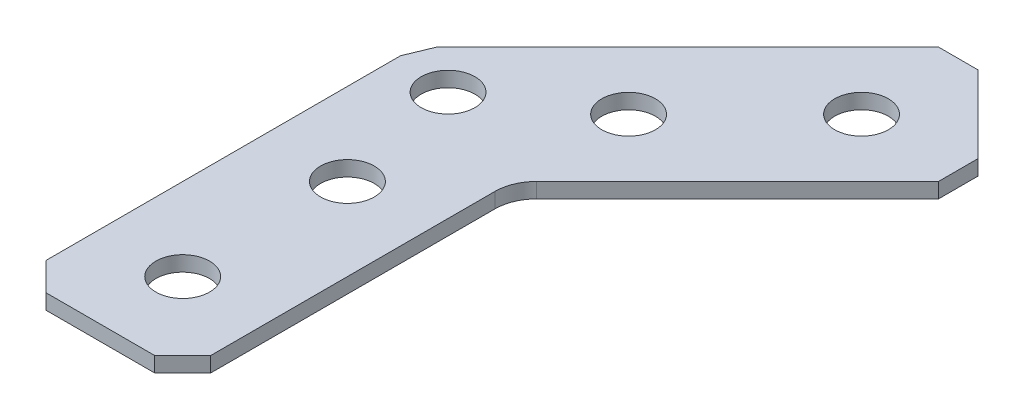
ISO-10303-21;
HEADER;
FILE_DESCRIPTION(('STEP AP214'),'2;1');
FILE_NAME('part.step','',(''),(''),'','','');
FILE_SCHEMA(('AUTOMOTIVE_DESIGN { 1 0 10303 214 1 1 1 1 }'));
ENDSEC;
DATA;
#1=APPLICATION_CONTEXT('core data for automotive mechanical design processes');
#2=APPLICATION_PROTOCOL_DEFINITION('international standard','automotive_design',2000,#1);
#3=PRODUCT_CONTEXT('',#1,'mechanical');
#4=PRODUCT('Part','Part','',(#3));
#5=PRODUCT_RELATED_PRODUCT_CATEGORY('part','',(#4));
#6=PRODUCT_DEFINITION_FORMATION('','',#4);
#7=PRODUCT_DEFINITION_CONTEXT('part definition',#1,'design');
#8=PRODUCT_DEFINITION('design','',#6,#7);
#9=PRODUCT_DEFINITION_SHAPE('','',#8);
#10=(LENGTH_UNIT() NAMED_UNIT(*) SI_UNIT(.MILLI.,.METRE.));
#11=(NAMED_UNIT(*) PLANE_ANGLE_UNIT() SI_UNIT($,.RADIAN.));
#12=(NAMED_UNIT(*) SI_UNIT($,.STERADIAN.) SOLID_ANGLE_UNIT());
#13=UNCERTAINTY_MEASURE_WITH_UNIT(LENGTH_MEASURE(1.E-05),#10,'distance_accuracy_value','');
#14=(GEOMETRIC_REPRESENTATION_CONTEXT(3) GLOBAL_UNCERTAINTY_ASSIGNED_CONTEXT((#13)) GLOBAL_UNIT_ASSIGNED_CONTEXT((#10,
#11,#12)) REPRESENTATION_CONTEXT('',''));
#15=CARTESIAN_POINT('',(0.,0.,0.));
#16=DIRECTION('',(0.,0.,1.));
#17=DIRECTION('',(1.,0.,0.));
#18=AXIS2_PLACEMENT_3D('',#15,#16,#17);
#19=CARTESIAN_POINT('',(-6.34999999999996,1.1684,12.7));
#20=DIRECTION('',(0.,-1.,0.));
#21=DIRECTION('',(0.,0.,-1.));
#22=AXIS2_PLACEMENT_3D('',#19,#20,#21);
#23=PLANE('',#22);
#24=CARTESIAN_POINT('',(15.3302561210692,1.1684,-30.6605122421383));
#25=DIRECTION('',(0.,-1.,0.));
#26=DIRECTION('',(0.,0.,-1.));
#27=AXIS2_PLACEMENT_3D('',#24,#25,#26);
#28=CIRCLE('',#27,2.0701);
#29=CARTESIAN_POINT('',(15.3302561210692,1.1684,-32.7306122421383));
#30=VERTEX_POINT('',#29);
#31=EDGE_CURVE('E229',#30,#30,#28,.T.);
#32=ORIENTED_EDGE('',*,*,#31,.T.);
#33=EDGE_LOOP('',(#32));
#34=FACE_BOUND('',#33,.T.);
#35=CARTESIAN_POINT('',(0.,1.1684,-6.35000000000009));
#36=DIRECTION('',(0.,-1.,0.));
#37=DIRECTION('',(0.,0.,-1.));
#38=AXIS2_PLACEMENT_3D('',#35,#36,#37);
#39=CIRCLE('',#38,2.07009999999998);
#40=CARTESIAN_POINT('',(0.,1.1684,-8.42010000000007));
#41=VERTEX_POINT('',#40);
#42=EDGE_CURVE('E232',#41,#41,#39,.T.);
#43=ORIENTED_EDGE('',*,*,#42,.T.);
#44=EDGE_LOOP('',(#43));
#45=FACE_BOUND('',#44,.T.);
#46=CARTESIAN_POINT('',(-2.08546691384424,1.1684,-16.1940848006638));
#47=DIRECTION('',(0.,-1.,0.));
#48=DIRECTION('',(0.,0.,-1.));
#49=AXIS2_PLACEMENT_3D('',#46,#47,#48);
#50=CIRCLE('',#49,2.0701);
#51=CARTESIAN_POINT('',(-2.08546691384424,1.1684,-18.2641848006638));
#52=VERTEX_POINT('',#51);
#53=EDGE_CURVE('E235',#52,#52,#50,.T.);
#54=ORIENTED_EDGE('',*,*,#53,.T.);
#55=EDGE_LOOP('',(#54));
#56=FACE_BOUND('',#55,.T.);
#57=DIRECTION('',(1.,0.,0.));
#58=VECTOR('',#57,1.);
#59=CARTESIAN_POINT('',(13.8036125804875,1.1684,-38.1141248226257));
#60=LINE('',#59,#58);
#61=CARTESIAN_POINT('',(16.856899661651,1.1684,-38.1141248226257));
#62=VERTEX_POINT('',#61);
#63=CARTESIAN_POINT('',(13.8036125804875,1.1684,-38.1141248226257));
#64=VERTEX_POINT('',#63);
#65=EDGE_CURVE('E168',#62,#64,#60,.F.);
#66=ORIENTED_EDGE('',*,*,#65,.T.);
#67=DIRECTION('',(0.707106781186549,0.,-0.707106781186546));
#68=VECTOR('',#67,1.);
#69=CARTESIAN_POINT('',(-5.52378646952377,1.1684,-18.7867257726145));
#70=LINE('',#69,#68);
#71=CARTESIAN_POINT('',(-5.52378646952377,1.1684,-18.7867257726145));
#72=VERTEX_POINT('',#71);
#73=EDGE_CURVE('E169',#64,#72,#70,.F.);
#74=ORIENTED_EDGE('',*,*,#73,.T.);
#75=DIRECTION('',(0.38268343236509,0.,-0.923879532511287));
#76=VECTOR('',#75,1.);
#77=CARTESIAN_POINT('',(-6.35,1.1684,-16.7920698619227));
#78=LINE('',#77,#76);
#79=CARTESIAN_POINT('',(-6.34999999999999,1.1684,-16.7920698619227));
#80=VERTEX_POINT('',#79);
#81=EDGE_CURVE('E180',#72,#80,#78,.F.);
#82=ORIENTED_EDGE('',*,*,#81,.T.);
#83=DIRECTION('',(0.,0.,-1.));
#84=VECTOR('',#83,1.);
#85=CARTESIAN_POINT('',(-6.34999999999999,1.1684,-12.7));
#86=LINE('',#85,#84);
#87=CARTESIAN_POINT('',(-6.34999999999998,1.1684,10.541));
#88=VERTEX_POINT('',#87);
#89=EDGE_CURVE('E472',#80,#88,#86,.F.);
#90=ORIENTED_EDGE('',*,*,#89,.T.);
#91=DIRECTION('',(-0.707106781186546,0.,-0.707106781186549));
#92=VECTOR('',#91,1.);
#93=CARTESIAN_POINT('',(-4.191,1.1684,12.7));
#94=LINE('',#93,#92);
#95=CARTESIAN_POINT('',(-4.191,1.1684,12.7));
#96=VERTEX_POINT('',#95);
#97=EDGE_CURVE('E474',#88,#96,#94,.F.);
#98=ORIENTED_EDGE('',*,*,#97,.T.);
#99=DIRECTION('',(-1.,0.,0.));
#100=VECTOR('',#99,1.);
#101=CARTESIAN_POINT('',(-6.34999999999999,1.1684,12.7));
#102=LINE('',#101,#100);
#103=CARTESIAN_POINT('',(4.19099999999999,1.1684,12.7));
#104=VERTEX_POINT('',#103);
#105=EDGE_CURVE('E479',#96,#104,#102,.F.);
#106=ORIENTED_EDGE('',*,*,#105,.T.);
#107=DIRECTION('',(-0.707106781186549,0.,0.707106781186546));
#108=VECTOR('',#107,1.);
#109=CARTESIAN_POINT('',(6.35,1.1684,10.541));
#110=LINE('',#109,#108);
#111=CARTESIAN_POINT('',(6.35,1.1684,10.541));
#112=VERTEX_POINT('',#111);
#113=EDGE_CURVE('E202',#104,#112,#110,.F.);
#114=ORIENTED_EDGE('',*,*,#113,.T.);
#115=DIRECTION('',(0.,0.,1.));
#116=VECTOR('',#115,1.);
#117=CARTESIAN_POINT('',(6.35,1.1684,-12.7));
#118=LINE('',#117,#116);
#119=CARTESIAN_POINT('',(6.35,1.1684,-11.3848719394654));
#120=VERTEX_POINT('',#119);
#121=EDGE_CURVE('E124',#112,#120,#118,.F.);
#122=ORIENTED_EDGE('',*,*,#121,.T.);
#123=CARTESIAN_POINT('',(9.525,1.1684,-11.3848719394654));
#124=DIRECTION('',(0.,1.,0.));
#125=DIRECTION('',(0.,0.,1.));
#126=AXIS2_PLACEMENT_3D('',#123,#124,#125);
#127=CIRCLE('',#126,3.175);
#128=CARTESIAN_POINT('',(7.27993596973271,1.1684,-13.6299359697327));
#129=VERTEX_POINT('',#128);
#130=EDGE_CURVE('E105',#120,#129,#127,.F.);
#131=ORIENTED_EDGE('',*,*,#130,.T.);
#132=DIRECTION('',(-0.707106781186549,0.,0.707106781186546));
#133=VECTOR('',#132,1.);
#134=CARTESIAN_POINT('',(24.3105122421383,1.1684,-30.6605122421383));
#135=LINE('',#134,#133);
#136=CARTESIAN_POINT('',(22.7838687015566,1.1684,-29.1338687015565));
#137=VERTEX_POINT('',#136);
#138=EDGE_CURVE('E110',#129,#137,#135,.F.);
#139=ORIENTED_EDGE('',*,*,#138,.T.);
#140=DIRECTION('',(0.,0.,1.));
#141=VECTOR('',#140,1.);
#142=CARTESIAN_POINT('',(22.7838687015566,1.1684,-32.18715578272));
#143=LINE('',#142,#141);
#144=CARTESIAN_POINT('',(22.7838687015566,1.1684,-32.18715578272));
#145=VERTEX_POINT('',#144);
#146=EDGE_CURVE('E119',#137,#145,#143,.F.);
#147=ORIENTED_EDGE('',*,*,#146,.T.);
#148=DIRECTION('',(0.707106781186546,0.,0.707106781186549));
#149=VECTOR('',#148,1.);
#150=CARTESIAN_POINT('',(15.3302561210692,1.1684,-39.6407683632074));
#151=LINE('',#150,#149);
#152=EDGE_CURVE('E158',#145,#62,#151,.F.);
#153=ORIENTED_EDGE('',*,*,#152,.T.);
#154=EDGE_LOOP('',(#66,#74,#82,#90,#98,#106,#114,#122,#131,#139,#147,#153));
#155=FACE_BOUND('',#154,.T.);
#156=CARTESIAN_POINT('',(0.,1.1684,6.35));
#157=DIRECTION('',(0.,-1.,0.));
#158=DIRECTION('',(0.,0.,-1.));
#159=AXIS2_PLACEMENT_3D('',#156,#157,#158);
#160=CIRCLE('',#159,2.0701);
#161=CARTESIAN_POINT('',(0.,1.1684,4.2799));
#162=VERTEX_POINT('',#161);
#163=EDGE_CURVE('E192',#162,#162,#160,.T.);
#164=ORIENTED_EDGE('',*,*,#163,.T.);
#165=EDGE_LOOP('',(#164));
#166=FACE_BOUND('',#165,.T.);
#167=CARTESIAN_POINT('',(6.34999999999998,1.1684,-21.6802561210692));
#168=DIRECTION('',(0.,-1.,0.));
#169=DIRECTION('',(0.,0.,-1.));
#170=AXIS2_PLACEMENT_3D('',#167,#168,#169);
#171=CIRCLE('',#170,2.0701);
#172=CARTESIAN_POINT('',(6.34999999999998,1.1684,-23.7503561210692));
#173=VERTEX_POINT('',#172);
#174=EDGE_CURVE('E21',#173,#173,#171,.T.);
#175=ORIENTED_EDGE('',*,*,#174,.T.);
#176=EDGE_LOOP('',(#175));
#177=FACE_BOUND('',#176,.T.);
#178=ADVANCED_FACE('F18',(#34,#45,#56,#155,#166,#177),#23,.F.);
#179=CARTESIAN_POINT('',(6.34999999999998,1.1684,-21.6802561210692));
#180=DIRECTION('',(0.,-1.,0.));
#181=DIRECTION('',(0.,0.,-1.));
#182=AXIS2_PLACEMENT_3D('',#179,#180,#181);
#183=CYLINDRICAL_SURFACE('',#182,2.0701);
#184=ORIENTED_EDGE('',*,*,#174,.F.);
#185=EDGE_LOOP('',(#184));
#186=FACE_BOUND('',#185,.T.);
#187=CARTESIAN_POINT('',(6.34999999999998,0.,-21.6802561210692));
#188=DIRECTION('',(0.,-1.,0.));
#189=DIRECTION('',(0.,0.,-1.));
#190=AXIS2_PLACEMENT_3D('',#187,#188,#189);
#191=CIRCLE('',#190,2.0701);
#192=CARTESIAN_POINT('',(6.34999999999998,0.,-23.7503561210692));
#193=VERTEX_POINT('',#192);
#194=EDGE_CURVE('E226',#193,#193,#191,.F.);
#195=ORIENTED_EDGE('',*,*,#194,.F.);
#196=EDGE_LOOP('',(#195));
#197=FACE_BOUND('',#196,.T.);
#198=ADVANCED_FACE('F243',(#186,#197),#183,.F.);
#199=CARTESIAN_POINT('',(0.,1.1684,6.35));
#200=DIRECTION('',(0.,-1.,0.));
#201=DIRECTION('',(0.,0.,-1.));
#202=AXIS2_PLACEMENT_3D('',#199,#200,#201);
#203=CYLINDRICAL_SURFACE('',#202,2.0701);
#204=ORIENTED_EDGE('',*,*,#163,.F.);
#205=EDGE_LOOP('',(#204));
#206=FACE_BOUND('',#205,.T.);
#207=CARTESIAN_POINT('',(0.,0.,6.35));
#208=DIRECTION('',(0.,-1.,0.));
#209=DIRECTION('',(0.,0.,-1.));
#210=AXIS2_PLACEMENT_3D('',#207,#208,#209);
#211=CIRCLE('',#210,2.0701);
#212=CARTESIAN_POINT('',(0.,0.,4.2799));
#213=VERTEX_POINT('',#212);
#214=EDGE_CURVE('E174',#213,#213,#211,.F.);
#215=ORIENTED_EDGE('',*,*,#214,.F.);
#216=EDGE_LOOP('',(#215));
#217=FACE_BOUND('',#216,.T.);
#218=ADVANCED_FACE('F246',(#206,#217),#203,.F.);
#219=CARTESIAN_POINT('',(-5.52378646952377,1.1684,-18.7867257726145));
#220=DIRECTION('',(0.707106781186546,0.,0.707106781186549));
#221=DIRECTION('',(0.707106781186549,0.,-0.707106781186546));
#222=AXIS2_PLACEMENT_3D('',#219,#220,#221);
#223=PLANE('',#222);
#224=DIRECTION('',(0.,1.,0.));
#225=VECTOR('',#224,1.);
#226=CARTESIAN_POINT('',(13.8036125804874,1.1684,-38.1141248226257));
#227=LINE('',#226,#225);
#228=CARTESIAN_POINT('',(13.8036125804875,0.,-38.1141248226257));
#229=VERTEX_POINT('',#228);
#230=EDGE_CURVE('E166',#64,#229,#227,.F.);
#231=ORIENTED_EDGE('',*,*,#230,.T.);
#232=DIRECTION('',(0.707106781186549,0.,-0.707106781186546));
#233=VECTOR('',#232,1.);
#234=CARTESIAN_POINT('',(-5.52378646952377,0.,-18.7867257726145));
#235=LINE('',#234,#233);
#236=CARTESIAN_POINT('',(-5.52378646952377,0.,-18.7867257726145));
#237=VERTEX_POINT('',#236);
#238=EDGE_CURVE('E163',#237,#229,#235,.T.);
#239=ORIENTED_EDGE('',*,*,#238,.F.);
#240=DIRECTION('',(0.,1.,0.));
#241=VECTOR('',#240,1.);
#242=CARTESIAN_POINT('',(-5.52378646952377,1.1684,-18.7867257726145));
#243=LINE('',#242,#241);
#244=EDGE_CURVE('E177',#237,#72,#243,.T.);
#245=ORIENTED_EDGE('',*,*,#244,.T.);
#246=ORIENTED_EDGE('',*,*,#73,.F.);
#247=EDGE_LOOP('',(#231,#239,#245,#246));
#248=FACE_BOUND('',#247,.T.);
#249=ADVANCED_FACE('F308',(#248),#223,.F.);
#250=CARTESIAN_POINT('',(13.8036125804875,1.1684,-38.1141248226257));
#251=DIRECTION('',(0.,0.,1.));
#252=DIRECTION('',(1.,0.,0.));
#253=AXIS2_PLACEMENT_3D('',#250,#251,#252);
#254=PLANE('',#253);
#255=DIRECTION('',(0.,1.,0.));
#256=VECTOR('',#255,1.);
#257=CARTESIAN_POINT('',(16.856899661651,1.1684,-38.1141248226257));
#258=LINE('',#257,#256);
#259=CARTESIAN_POINT('',(16.8568996616509,0.,-38.1141248226257));
#260=VERTEX_POINT('',#259);
#261=EDGE_CURVE('E149',#62,#260,#258,.F.);
#262=ORIENTED_EDGE('',*,*,#261,.T.);
#263=DIRECTION('',(1.,0.,0.));
#264=VECTOR('',#263,1.);
#265=CARTESIAN_POINT('',(-6.34999999999996,0.,-38.1141248226257));
#266=LINE('',#265,#264);
#267=EDGE_CURVE('E154',#229,#260,#266,.T.);
#268=ORIENTED_EDGE('',*,*,#267,.F.);
#269=ORIENTED_EDGE('',*,*,#230,.F.);
#270=ORIENTED_EDGE('',*,*,#65,.F.);
#271=EDGE_LOOP('',(#262,#268,#269,#270));
#272=FACE_BOUND('',#271,.T.);
#273=ADVANCED_FACE('F304',(#272),#254,.F.);
#274=CARTESIAN_POINT('',(15.3302561210692,1.1684,-39.6407683632074));
#275=DIRECTION('',(-0.707106781186549,0.,0.707106781186546));
#276=DIRECTION('',(0.707106781186546,0.,0.707106781186549));
#277=AXIS2_PLACEMENT_3D('',#274,#275,#276);
#278=PLANE('',#277);
#279=ORIENTED_EDGE('',*,*,#261,.F.);
#280=ORIENTED_EDGE('',*,*,#152,.F.);
#281=DIRECTION('',(0.,1.,0.));
#282=VECTOR('',#281,1.);
#283=CARTESIAN_POINT('',(22.7838687015566,1.1684,-32.18715578272));
#284=LINE('',#283,#282);
#285=CARTESIAN_POINT('',(22.7838687015566,0.,-32.18715578272));
#286=VERTEX_POINT('',#285);
#287=EDGE_CURVE('E147',#145,#286,#284,.F.);
#288=ORIENTED_EDGE('',*,*,#287,.T.);
#289=DIRECTION('',(0.707106781186546,0.,0.707106781186549));
#290=VECTOR('',#289,1.);
#291=CARTESIAN_POINT('',(16.856899661651,0.,-38.1141248226257));
#292=LINE('',#291,#290);
#293=EDGE_CURVE('E144',#260,#286,#292,.T.);
#294=ORIENTED_EDGE('',*,*,#293,.F.);
#295=EDGE_LOOP('',(#279,#280,#288,#294));
#296=FACE_BOUND('',#295,.T.);
#297=ADVANCED_FACE('F300',(#296),#278,.F.);
#298=CARTESIAN_POINT('',(22.7838687015566,1.1684,-32.18715578272));
#299=DIRECTION('',(-1.,0.,0.));
#300=DIRECTION('',(0.,0.,1.));
#301=AXIS2_PLACEMENT_3D('',#298,#299,#300);
#302=PLANE('',#301);
#303=DIRECTION('',(0.,1.,0.));
#304=VECTOR('',#303,1.);
#305=CARTESIAN_POINT('',(22.7838687015566,1.1684,-29.1338687015565));
#306=LINE('',#305,#304);
#307=CARTESIAN_POINT('',(22.7838687015566,0.,-29.1338687015565));
#308=VERTEX_POINT('',#307);
#309=EDGE_CURVE('E115',#137,#308,#306,.F.);
#310=ORIENTED_EDGE('',*,*,#309,.T.);
#311=DIRECTION('',(0.,0.,-1.));
#312=VECTOR('',#311,1.);
#313=CARTESIAN_POINT('',(22.7838687015566,0.,12.7));
#314=LINE('',#313,#312);
#315=EDGE_CURVE('E140',#286,#308,#314,.F.);
#316=ORIENTED_EDGE('',*,*,#315,.F.);
#317=ORIENTED_EDGE('',*,*,#287,.F.);
#318=ORIENTED_EDGE('',*,*,#146,.F.);
#319=EDGE_LOOP('',(#310,#316,#317,#318));
#320=FACE_BOUND('',#319,.T.);
#321=ADVANCED_FACE('F297',(#320),#302,.F.);
#322=CARTESIAN_POINT('',(24.3105122421383,1.1684,-30.6605122421383));
#323=DIRECTION('',(-0.707106781186546,0.,-0.707106781186549));
#324=DIRECTION('',(-0.707106781186549,0.,0.707106781186546));
#325=AXIS2_PLACEMENT_3D('',#322,#323,#324);
#326=PLANE('',#325);
#327=ORIENTED_EDGE('',*,*,#309,.F.);
#328=ORIENTED_EDGE('',*,*,#138,.F.);
#329=DIRECTION('',(0.,1.,0.));
#330=VECTOR('',#329,1.);
#331=CARTESIAN_POINT('',(7.27993596973271,1.1684,-13.6299359697327));
#332=LINE('',#331,#330);
#333=CARTESIAN_POINT('',(7.27993596973271,0.,-13.6299359697327));
#334=VERTEX_POINT('',#333);
#335=EDGE_CURVE('E113',#129,#334,#332,.F.);
#336=ORIENTED_EDGE('',*,*,#335,.T.);
#337=DIRECTION('',(-0.707106781186549,0.,0.707106781186546));
#338=VECTOR('',#337,1.);
#339=CARTESIAN_POINT('',(22.7838687015566,0.,-29.1338687015565));
#340=LINE('',#339,#338);
#341=EDGE_CURVE('E143',#308,#334,#340,.T.);
#342=ORIENTED_EDGE('',*,*,#341,.F.);
#343=EDGE_LOOP('',(#327,#328,#336,#342));
#344=FACE_BOUND('',#343,.T.);
#345=ADVANCED_FACE('F111',(#344),#326,.F.);
#346=CARTESIAN_POINT('',(9.525,1.1684,-11.3848719394654));
#347=DIRECTION('',(0.,1.,0.));
#348=DIRECTION('',(0.,0.,1.));
#349=AXIS2_PLACEMENT_3D('',#346,#347,#348);
#350=CYLINDRICAL_SURFACE('',#349,3.175);
#351=DIRECTION('',(0.,1.,0.));
#352=VECTOR('',#351,1.);
#353=CARTESIAN_POINT('',(6.35,1.1684,-11.3848719394654));
#354=LINE('',#353,#352);
#355=CARTESIAN_POINT('',(6.35,0.,-11.3848719394654));
#356=VERTEX_POINT('',#355);
#357=EDGE_CURVE('E126',#120,#356,#354,.F.);
#358=ORIENTED_EDGE('',*,*,#357,.T.);
#359=CARTESIAN_POINT('',(9.525,0.,-11.3848719394654));
#360=DIRECTION('',(0.,1.,0.));
#361=DIRECTION('',(0.,0.,1.));
#362=AXIS2_PLACEMENT_3D('',#359,#360,#361);
#363=CIRCLE('',#362,3.175);
#364=EDGE_CURVE('E130',#334,#356,#363,.T.);
#365=ORIENTED_EDGE('',*,*,#364,.F.);
#366=ORIENTED_EDGE('',*,*,#335,.F.);
#367=ORIENTED_EDGE('',*,*,#130,.F.);
#368=EDGE_LOOP('',(#358,#365,#366,#367));
#369=FACE_BOUND('',#368,.T.);
#370=ADVANCED_FACE('F128',(#369),#350,.F.);
#371=CARTESIAN_POINT('',(6.35,1.1684,-12.7));
#372=DIRECTION('',(-1.,0.,0.));
#373=DIRECTION('',(0.,0.,1.));
#374=AXIS2_PLACEMENT_3D('',#371,#372,#373);
#375=PLANE('',#374);
#376=DIRECTION('',(0.,1.,0.));
#377=VECTOR('',#376,1.);
#378=CARTESIAN_POINT('',(6.35,1.1684,10.541));
#379=LINE('',#378,#377);
#380=CARTESIAN_POINT('',(6.35,0.,10.541));
#381=VERTEX_POINT('',#380);
#382=EDGE_CURVE('E199',#112,#381,#379,.F.);
#383=ORIENTED_EDGE('',*,*,#382,.T.);
#384=DIRECTION('',(0.,0.,-1.));
#385=VECTOR('',#384,1.);
#386=CARTESIAN_POINT('',(6.35,0.,12.7));
#387=LINE('',#386,#385);
#388=EDGE_CURVE('E223',#356,#381,#387,.F.);
#389=ORIENTED_EDGE('',*,*,#388,.F.);
#390=ORIENTED_EDGE('',*,*,#357,.F.);
#391=ORIENTED_EDGE('',*,*,#121,.F.);
#392=EDGE_LOOP('',(#383,#389,#390,#391));
#393=FACE_BOUND('',#392,.T.);
#394=ADVANCED_FACE('F288',(#393),#375,.F.);
#395=CARTESIAN_POINT('',(6.35,1.1684,10.541));
#396=DIRECTION('',(-0.707106781186546,0.,-0.707106781186549));
#397=DIRECTION('',(-0.707106781186549,0.,0.707106781186546));
#398=AXIS2_PLACEMENT_3D('',#395,#396,#397);
#399=PLANE('',#398);
#400=DIRECTION('',(0.,1.,0.));
#401=VECTOR('',#400,1.);
#402=CARTESIAN_POINT('',(4.19099999999999,1.1684,12.7));
#403=LINE('',#402,#401);
#404=CARTESIAN_POINT('',(4.19099999999999,0.,12.7));
#405=VERTEX_POINT('',#404);
#406=EDGE_CURVE('E204',#104,#405,#403,.F.);
#407=ORIENTED_EDGE('',*,*,#406,.T.);
#408=DIRECTION('',(-0.70710678118655,0.,0.707106781186546));
#409=VECTOR('',#408,1.);
#410=CARTESIAN_POINT('',(6.35,0.,10.541));
#411=LINE('',#410,#409);
#412=EDGE_CURVE('E462',#381,#405,#411,.T.);
#413=ORIENTED_EDGE('',*,*,#412,.F.);
#414=ORIENTED_EDGE('',*,*,#382,.F.);
#415=ORIENTED_EDGE('',*,*,#113,.F.);
#416=EDGE_LOOP('',(#407,#413,#414,#415));
#417=FACE_BOUND('',#416,.T.);
#418=ADVANCED_FACE('F284',(#417),#399,.F.);
#419=CARTESIAN_POINT('',(-6.34999999999999,1.1684,12.7));
#420=DIRECTION('',(0.,0.,-1.));
#421=DIRECTION('',(-1.,0.,0.));
#422=AXIS2_PLACEMENT_3D('',#419,#420,#421);
#423=PLANE('',#422);
#424=DIRECTION('',(0.,1.,0.));
#425=VECTOR('',#424,1.);
#426=CARTESIAN_POINT('',(-4.191,1.1684,12.7));
#427=LINE('',#426,#425);
#428=CARTESIAN_POINT('',(-4.191,0.,12.7));
#429=VERTEX_POINT('',#428);
#430=EDGE_CURVE('E477',#96,#429,#427,.F.);
#431=ORIENTED_EDGE('',*,*,#430,.T.);
#432=DIRECTION('',(1.,0.,0.));
#433=VECTOR('',#432,1.);
#434=CARTESIAN_POINT('',(-6.34999999999996,0.,12.7));
#435=LINE('',#434,#433);
#436=EDGE_CURVE('E458',#405,#429,#435,.F.);
#437=ORIENTED_EDGE('',*,*,#436,.F.);
#438=ORIENTED_EDGE('',*,*,#406,.F.);
#439=ORIENTED_EDGE('',*,*,#105,.F.);
#440=EDGE_LOOP('',(#431,#437,#438,#439));
#441=FACE_BOUND('',#440,.T.);
#442=ADVANCED_FACE('F280',(#441),#423,.F.);
#443=CARTESIAN_POINT('',(-4.191,1.1684,12.7));
#444=DIRECTION('',(0.707106781186549,0.,-0.707106781186546));
#445=DIRECTION('',(-0.707106781186546,0.,-0.707106781186549));
#446=AXIS2_PLACEMENT_3D('',#443,#444,#445);
#447=PLANE('',#446);
#448=DIRECTION('',(0.,1.,0.));
#449=VECTOR('',#448,1.);
#450=CARTESIAN_POINT('',(-6.34999999999999,1.1684,10.541));
#451=LINE('',#450,#449);
#452=CARTESIAN_POINT('',(-6.34999999999999,0.,10.541));
#453=VERTEX_POINT('',#452);
#454=EDGE_CURVE('E181',#88,#453,#451,.F.);
#455=ORIENTED_EDGE('',*,*,#454,.T.);
#456=DIRECTION('',(-0.707106781186546,0.,-0.707106781186549));
#457=VECTOR('',#456,1.);
#458=CARTESIAN_POINT('',(-4.191,0.,12.7));
#459=LINE('',#458,#457);
#460=EDGE_CURVE('E455',#429,#453,#459,.T.);
#461=ORIENTED_EDGE('',*,*,#460,.F.);
#462=ORIENTED_EDGE('',*,*,#430,.F.);
#463=ORIENTED_EDGE('',*,*,#97,.F.);
#464=EDGE_LOOP('',(#455,#461,#462,#463));
#465=FACE_BOUND('',#464,.T.);
#466=ADVANCED_FACE('F277',(#465),#447,.F.);
#467=CARTESIAN_POINT('',(-6.34999999999999,1.1684,-12.7));
#468=DIRECTION('',(1.,0.,0.));
#469=DIRECTION('',(0.,0.,-1.));
#470=AXIS2_PLACEMENT_3D('',#467,#468,#469);
#471=PLANE('',#470);
#472=ORIENTED_EDGE('',*,*,#454,.F.);
#473=ORIENTED_EDGE('',*,*,#89,.F.);
#474=DIRECTION('',(0.,1.,0.));
#475=VECTOR('',#474,1.);
#476=CARTESIAN_POINT('',(-6.35,1.1684,-16.7920698619227));
#477=LINE('',#476,#475);
#478=CARTESIAN_POINT('',(-6.35,0.,-16.7920698619227));
#479=VERTEX_POINT('',#478);
#480=EDGE_CURVE('E36',#80,#479,#477,.F.);
#481=ORIENTED_EDGE('',*,*,#480,.T.);
#482=DIRECTION('',(0.,0.,-1.));
#483=VECTOR('',#482,1.);
#484=CARTESIAN_POINT('',(-6.34999999999999,0.,12.7));
#485=LINE('',#484,#483);
#486=EDGE_CURVE('E188',#453,#479,#485,.T.);
#487=ORIENTED_EDGE('',*,*,#486,.F.);
#488=EDGE_LOOP('',(#472,#473,#481,#487));
#489=FACE_BOUND('',#488,.T.);
#490=ADVANCED_FACE('F273',(#489),#471,.F.);
#491=CARTESIAN_POINT('',(-6.35,1.1684,-16.7920698619227));
#492=DIRECTION('',(0.923879532511287,0.,0.38268343236509));
#493=DIRECTION('',(0.38268343236509,0.,-0.923879532511287));
#494=AXIS2_PLACEMENT_3D('',#491,#492,#493);
#495=PLANE('',#494);
#496=ORIENTED_EDGE('',*,*,#480,.F.);
#497=ORIENTED_EDGE('',*,*,#81,.F.);
#498=ORIENTED_EDGE('',*,*,#244,.F.);
#499=DIRECTION('',(0.38268343236509,0.,-0.923879532511287));
#500=VECTOR('',#499,1.);
#501=CARTESIAN_POINT('',(-6.35,0.,-16.7920698619227));
#502=LINE('',#501,#500);
#503=EDGE_CURVE('E184',#479,#237,#502,.T.);
#504=ORIENTED_EDGE('',*,*,#503,.F.);
#505=EDGE_LOOP('',(#496,#497,#498,#504));
#506=FACE_BOUND('',#505,.T.);
#507=ADVANCED_FACE('F269',(#506),#495,.F.);
#508=CARTESIAN_POINT('',(-2.08546691384424,1.1684,-16.1940848006638));
#509=DIRECTION('',(0.,-1.,0.));
#510=DIRECTION('',(0.,0.,-1.));
#511=AXIS2_PLACEMENT_3D('',#508,#509,#510);
#512=CYLINDRICAL_SURFACE('',#511,2.0701);
#513=ORIENTED_EDGE('',*,*,#53,.F.);
#514=EDGE_LOOP('',(#513));
#515=FACE_BOUND('',#514,.T.);
#516=CARTESIAN_POINT('',(-2.08546691384424,0.,-16.1940848006638));
#517=DIRECTION('',(0.,-1.,0.));
#518=DIRECTION('',(0.,0.,-1.));
#519=AXIS2_PLACEMENT_3D('',#516,#517,#518);
#520=CIRCLE('',#519,2.0701);
#521=CARTESIAN_POINT('',(-2.08546691384424,0.,-18.2641848006638));
#522=VERTEX_POINT('',#521);
#523=EDGE_CURVE('E187',#522,#522,#520,.F.);
#524=ORIENTED_EDGE('',*,*,#523,.F.);
#525=EDGE_LOOP('',(#524));
#526=FACE_BOUND('',#525,.T.);
#527=ADVANCED_FACE('F265',(#515,#526),#512,.F.);
#528=CARTESIAN_POINT('',(0.,1.1684,-6.35000000000009));
#529=DIRECTION('',(0.,-1.,0.));
#530=DIRECTION('',(0.,0.,-1.));
#531=AXIS2_PLACEMENT_3D('',#528,#529,#530);
#532=CYLINDRICAL_SURFACE('',#531,2.07009999999998);
#533=ORIENTED_EDGE('',*,*,#42,.F.);
#534=EDGE_LOOP('',(#533));
#535=FACE_BOUND('',#534,.T.);
#536=CARTESIAN_POINT('',(0.,0.,-6.35000000000009));
#537=DIRECTION('',(0.,-1.,0.));
#538=DIRECTION('',(0.,0.,-1.));
#539=AXIS2_PLACEMENT_3D('',#536,#537,#538);
#540=CIRCLE('',#539,2.07009999999998);
#541=CARTESIAN_POINT('',(0.,0.,-8.42010000000007));
#542=VERTEX_POINT('',#541);
#543=EDGE_CURVE('E27',#542,#542,#540,.F.);
#544=ORIENTED_EDGE('',*,*,#543,.F.);
#545=EDGE_LOOP('',(#544));
#546=FACE_BOUND('',#545,.T.);
#547=ADVANCED_FACE('F258',(#535,#546),#532,.F.);
#548=CARTESIAN_POINT('',(15.3302561210692,1.1684,-30.6605122421383));
#549=DIRECTION('',(0.,-1.,0.));
#550=DIRECTION('',(0.,0.,-1.));
#551=AXIS2_PLACEMENT_3D('',#548,#549,#550);
#552=CYLINDRICAL_SURFACE('',#551,2.0701);
#553=ORIENTED_EDGE('',*,*,#31,.F.);
#554=EDGE_LOOP('',(#553));
#555=FACE_BOUND('',#554,.T.);
#556=CARTESIAN_POINT('',(15.3302561210692,0.,-30.6605122421383));
#557=DIRECTION('',(0.,-1.,0.));
#558=DIRECTION('',(0.,0.,-1.));
#559=AXIS2_PLACEMENT_3D('',#556,#557,#558);
#560=CIRCLE('',#559,2.0701);
#561=CARTESIAN_POINT('',(15.3302561210692,0.,-32.7306122421383));
#562=VERTEX_POINT('',#561);
#563=EDGE_CURVE('E11',#562,#562,#560,.F.);
#564=ORIENTED_EDGE('',*,*,#563,.F.);
#565=EDGE_LOOP('',(#564));
#566=FACE_BOUND('',#565,.T.);
#567=ADVANCED_FACE('F251',(#555,#566),#552,.F.);
#568=CARTESIAN_POINT('',(-6.34999999999996,0.,12.7));
#569=DIRECTION('',(0.,-1.,0.));
#570=DIRECTION('',(0.,0.,-1.));
#571=AXIS2_PLACEMENT_3D('',#568,#569,#570);
#572=PLANE('',#571);
#573=ORIENTED_EDGE('',*,*,#563,.T.);
#574=EDGE_LOOP('',(#573));
#575=FACE_BOUND('',#574,.T.);
#576=ORIENTED_EDGE('',*,*,#543,.T.);
#577=EDGE_LOOP('',(#576));
#578=FACE_BOUND('',#577,.T.);
#579=ORIENTED_EDGE('',*,*,#523,.T.);
#580=EDGE_LOOP('',(#579));
#581=FACE_BOUND('',#580,.T.);
#582=ORIENTED_EDGE('',*,*,#486,.T.);
#583=ORIENTED_EDGE('',*,*,#503,.T.);
#584=ORIENTED_EDGE('',*,*,#238,.T.);
#585=ORIENTED_EDGE('',*,*,#267,.T.);
#586=ORIENTED_EDGE('',*,*,#293,.T.);
#587=ORIENTED_EDGE('',*,*,#315,.T.);
#588=ORIENTED_EDGE('',*,*,#341,.T.);
#589=ORIENTED_EDGE('',*,*,#364,.T.);
#590=ORIENTED_EDGE('',*,*,#388,.T.);
#591=ORIENTED_EDGE('',*,*,#412,.T.);
#592=ORIENTED_EDGE('',*,*,#436,.T.);
#593=ORIENTED_EDGE('',*,*,#460,.T.);
#594=EDGE_LOOP('',(#582,#583,#584,#585,#586,#587,#588,#589,#590,#591,#592,#593));
#595=FACE_BOUND('',#594,.T.);
#596=ORIENTED_EDGE('',*,*,#214,.T.);
#597=EDGE_LOOP('',(#596));
#598=FACE_BOUND('',#597,.T.);
#599=ORIENTED_EDGE('',*,*,#194,.T.);
#600=EDGE_LOOP('',(#599));
#601=FACE_BOUND('',#600,.T.);
#602=ADVANCED_FACE('F249',(#575,#578,#581,#595,#598,#601),#572,.T.);
#603=CLOSED_SHELL('',(#178,#198,#218,#249,#273,#297,#321,#345,#370,#394,#418,#442,#466,#490,
#507,#527,#547,#567,#602));
#604=MANIFOLD_SOLID_BREP('B1',#603);
#605=ADVANCED_BREP_SHAPE_REPRESENTATION('',(#18,#604),#14);
#606=SHAPE_DEFINITION_REPRESENTATION(#9,#605);
ENDSEC;
END-ISO-10303-21;
